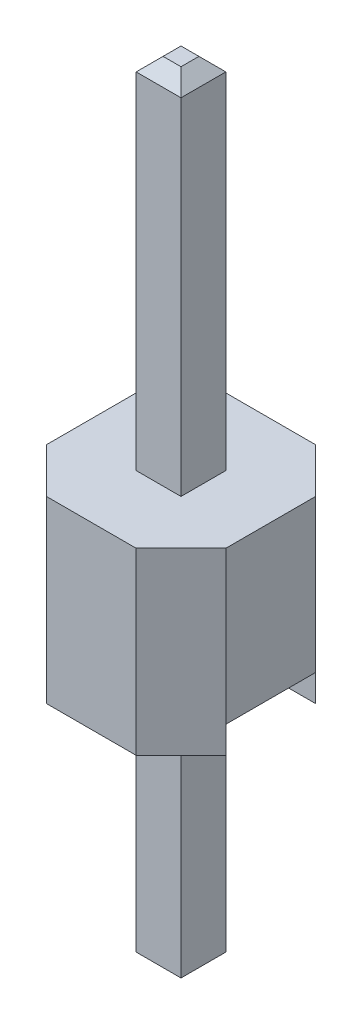
ISO-10303-21;
HEADER;
FILE_DESCRIPTION(('STEP AP214'),'2;1');
FILE_NAME('part.step','',(''),(''),'','','');
FILE_SCHEMA(('AUTOMOTIVE_DESIGN { 1 0 10303 214 1 1 1 1 }'));
ENDSEC;
DATA;
#1=APPLICATION_CONTEXT('core data for automotive mechanical design processes');
#2=APPLICATION_PROTOCOL_DEFINITION('international standard','automotive_design',2000,#1);
#3=PRODUCT_CONTEXT('',#1,'mechanical');
#4=PRODUCT('Part','Part','',(#3));
#5=PRODUCT_RELATED_PRODUCT_CATEGORY('part','',(#4));
#6=PRODUCT_DEFINITION_FORMATION('','',#4);
#7=PRODUCT_DEFINITION_CONTEXT('part definition',#1,'design');
#8=PRODUCT_DEFINITION('design','',#6,#7);
#9=PRODUCT_DEFINITION_SHAPE('','',#8);
#10=(LENGTH_UNIT() NAMED_UNIT(*) SI_UNIT(.MILLI.,.METRE.));
#11=(NAMED_UNIT(*) PLANE_ANGLE_UNIT() SI_UNIT($,.RADIAN.));
#12=(NAMED_UNIT(*) SI_UNIT($,.STERADIAN.) SOLID_ANGLE_UNIT());
#13=UNCERTAINTY_MEASURE_WITH_UNIT(LENGTH_MEASURE(1.E-05),#10,'distance_accuracy_value','');
#14=(GEOMETRIC_REPRESENTATION_CONTEXT(3) GLOBAL_UNCERTAINTY_ASSIGNED_CONTEXT((#13)) GLOBAL_UNIT_ASSIGNED_CONTEXT((#10,
#11,#12)) REPRESENTATION_CONTEXT('',''));
#15=CARTESIAN_POINT('',(0.,0.,0.));
#16=DIRECTION('',(0.,0.,1.));
#17=DIRECTION('',(1.,0.,0.));
#18=AXIS2_PLACEMENT_3D('',#15,#16,#17);
#19=CARTESIAN_POINT('',(-0.127000000000002,-3.556,0.));
#20=DIRECTION('',(0.707106781186548,0.707106781186548,0.));
#21=DIRECTION('',(0.,0.,-1.));
#22=AXIS2_PLACEMENT_3D('',#19,#20,#21);
#23=PLANE('',#22);
#24=DIRECTION('',(-0.577350269189626,0.577350269189626,0.577350269189626));
#25=VECTOR('',#24,1.);
#26=CARTESIAN_POINT('',(-0.084666666666668,-3.59833333333333,0.0846666666666681));
#27=LINE('',#26,#25);
#28=CARTESIAN_POINT('',(-0.127000000000002,-3.556,0.127000000000002));
#29=VERTEX_POINT('',#28);
#30=CARTESIAN_POINT('',(-0.3175,-3.3655,0.3175));
#31=VERTEX_POINT('',#30);
#32=EDGE_CURVE('E29',#29,#31,#27,.T.);
#33=ORIENTED_EDGE('',*,*,#32,.T.);
#34=DIRECTION('',(0.,0.,1.));
#35=VECTOR('',#34,1.);
#36=CARTESIAN_POINT('',(-0.3175,-3.3655,-0.3175));
#37=LINE('',#36,#35);
#38=CARTESIAN_POINT('',(-0.3175,-3.3655,-0.3175));
#39=VERTEX_POINT('',#38);
#40=EDGE_CURVE('E273',#39,#31,#37,.T.);
#41=ORIENTED_EDGE('',*,*,#40,.F.);
#42=DIRECTION('',(0.577350269189626,-0.577350269189626,0.577350269189626));
#43=VECTOR('',#42,1.);
#44=CARTESIAN_POINT('',(-0.084666666666668,-3.59833333333333,-0.084666666666668));
#45=LINE('',#44,#43);
#46=CARTESIAN_POINT('',(-0.127000000000002,-3.556,-0.127000000000002));
#47=VERTEX_POINT('',#46);
#48=EDGE_CURVE('E11',#39,#47,#45,.T.);
#49=ORIENTED_EDGE('',*,*,#48,.T.);
#50=DIRECTION('',(0.,0.,-1.));
#51=VECTOR('',#50,1.);
#52=CARTESIAN_POINT('',(-0.127000000000002,-3.556,0.));
#53=LINE('',#52,#51);
#54=EDGE_CURVE('E256',#29,#47,#53,.T.);
#55=ORIENTED_EDGE('',*,*,#54,.F.);
#56=EDGE_LOOP('',(#33,#41,#49,#55));
#57=FACE_BOUND('',#56,.T.);
#58=ADVANCED_FACE('F18',(#57),#23,.F.);
#59=CARTESIAN_POINT('',(0.,-3.556,-0.127000000000002));
#60=DIRECTION('',(0.,0.707106781186548,0.707106781186548));
#61=DIRECTION('',(1.,0.,0.));
#62=AXIS2_PLACEMENT_3D('',#59,#60,#61);
#63=PLANE('',#62);
#64=DIRECTION('',(-0.577350269189626,-0.577350269189626,0.577350269189626));
#65=VECTOR('',#64,1.);
#66=CARTESIAN_POINT('',(0.084666666666668,-3.59833333333333,-0.084666666666668));
#67=LINE('',#66,#65);
#68=CARTESIAN_POINT('',(0.3175,-3.3655,-0.3175));
#69=VERTEX_POINT('',#68);
#70=CARTESIAN_POINT('',(0.127000000000002,-3.556,-0.127000000000002));
#71=VERTEX_POINT('',#70);
#72=EDGE_CURVE('E44',#69,#71,#67,.T.);
#73=ORIENTED_EDGE('',*,*,#72,.T.);
#74=DIRECTION('',(1.,0.,0.));
#75=VECTOR('',#74,1.);
#76=CARTESIAN_POINT('',(0.,-3.556,-0.127000000000002));
#77=LINE('',#76,#75);
#78=EDGE_CURVE('E260',#47,#71,#77,.T.);
#79=ORIENTED_EDGE('',*,*,#78,.F.);
#80=ORIENTED_EDGE('',*,*,#48,.F.);
#81=DIRECTION('',(-1.,0.,0.));
#82=VECTOR('',#81,1.);
#83=CARTESIAN_POINT('',(-0.3175,-3.3655,-0.3175));
#84=LINE('',#83,#82);
#85=EDGE_CURVE('E266',#69,#39,#84,.T.);
#86=ORIENTED_EDGE('',*,*,#85,.F.);
#87=EDGE_LOOP('',(#73,#79,#80,#86));
#88=FACE_BOUND('',#87,.T.);
#89=ADVANCED_FACE('F431',(#88),#63,.F.);
#90=CARTESIAN_POINT('',(0.,-3.556,0.127000000000002));
#91=DIRECTION('',(0.,0.707106781186548,-0.707106781186548));
#92=DIRECTION('',(-1.,0.,0.));
#93=AXIS2_PLACEMENT_3D('',#90,#91,#92);
#94=PLANE('',#93);
#95=DIRECTION('',(0.577350269189626,0.577350269189626,0.577350269189626));
#96=VECTOR('',#95,1.);
#97=CARTESIAN_POINT('',(0.084666666666668,-3.59833333333333,0.0846666666666681));
#98=LINE('',#97,#96);
#99=CARTESIAN_POINT('',(0.127000000000002,-3.556,0.127000000000002));
#100=VERTEX_POINT('',#99);
#101=CARTESIAN_POINT('',(0.3175,-3.3655,0.3175));
#102=VERTEX_POINT('',#101);
#103=EDGE_CURVE('E254',#100,#102,#98,.T.);
#104=ORIENTED_EDGE('',*,*,#103,.T.);
#105=DIRECTION('',(1.,0.,0.));
#106=VECTOR('',#105,1.);
#107=CARTESIAN_POINT('',(-0.3175,-3.3655,0.3175));
#108=LINE('',#107,#106);
#109=EDGE_CURVE('E248',#31,#102,#108,.T.);
#110=ORIENTED_EDGE('',*,*,#109,.F.);
#111=ORIENTED_EDGE('',*,*,#32,.F.);
#112=DIRECTION('',(-1.,0.,0.));
#113=VECTOR('',#112,1.);
#114=CARTESIAN_POINT('',(0.,-3.556,0.127000000000002));
#115=LINE('',#114,#113);
#116=EDGE_CURVE('E247',#100,#29,#115,.T.);
#117=ORIENTED_EDGE('',*,*,#116,.F.);
#118=EDGE_LOOP('',(#104,#110,#111,#117));
#119=FACE_BOUND('',#118,.T.);
#120=ADVANCED_FACE('F245',(#119),#94,.F.);
#121=CARTESIAN_POINT('',(0.127000000000002,-3.556,0.));
#122=DIRECTION('',(-0.707106781186548,0.707106781186548,0.));
#123=DIRECTION('',(0.,0.,1.));
#124=AXIS2_PLACEMENT_3D('',#121,#122,#123);
#125=PLANE('',#124);
#126=ORIENTED_EDGE('',*,*,#72,.F.);
#127=DIRECTION('',(0.,0.,-1.));
#128=VECTOR('',#127,1.);
#129=CARTESIAN_POINT('',(0.3175,-3.3655,-0.3175));
#130=LINE('',#129,#128);
#131=EDGE_CURVE('E332',#102,#69,#130,.T.);
#132=ORIENTED_EDGE('',*,*,#131,.F.);
#133=ORIENTED_EDGE('',*,*,#103,.F.);
#134=DIRECTION('',(0.,0.,1.));
#135=VECTOR('',#134,1.);
#136=CARTESIAN_POINT('',(0.127000000000002,-3.556,0.));
#137=LINE('',#136,#135);
#138=EDGE_CURVE('E264',#71,#100,#137,.T.);
#139=ORIENTED_EDGE('',*,*,#138,.F.);
#140=EDGE_LOOP('',(#126,#132,#133,#139));
#141=FACE_BOUND('',#140,.T.);
#142=ADVANCED_FACE('F439',(#141),#125,.F.);
#143=CARTESIAN_POINT('',(0.,-3.556,0.));
#144=DIRECTION('',(0.,1.,0.));
#145=DIRECTION('',(1.,0.,0.));
#146=AXIS2_PLACEMENT_3D('',#143,#144,#145);
#147=PLANE('',#146);
#148=ORIENTED_EDGE('',*,*,#116,.T.);
#149=ORIENTED_EDGE('',*,*,#54,.T.);
#150=ORIENTED_EDGE('',*,*,#78,.T.);
#151=ORIENTED_EDGE('',*,*,#138,.T.);
#152=EDGE_LOOP('',(#148,#149,#150,#151));
#153=FACE_BOUND('',#152,.T.);
#154=ADVANCED_FACE('F263',(#153),#147,.F.);
#155=CARTESIAN_POINT('',(-0.3175,-3.556,-0.3175));
#156=DIRECTION('',(0.,0.,1.));
#157=DIRECTION('',(1.,0.,0.));
#158=AXIS2_PLACEMENT_3D('',#155,#156,#157);
#159=PLANE('',#158);
#160=DIRECTION('',(0.,1.,0.));
#161=VECTOR('',#160,1.);
#162=CARTESIAN_POINT('',(0.3175,-3.556,-0.3175));
#163=LINE('',#162,#161);
#164=CARTESIAN_POINT('',(0.3175,0.381,-0.3175));
#165=VERTEX_POINT('',#164);
#166=EDGE_CURVE('E99',#69,#165,#163,.T.);
#167=ORIENTED_EDGE('',*,*,#166,.F.);
#168=ORIENTED_EDGE('',*,*,#85,.T.);
#169=DIRECTION('',(0.,1.,0.));
#170=VECTOR('',#169,1.);
#171=CARTESIAN_POINT('',(-0.3175,-3.556,-0.3175));
#172=LINE('',#171,#170);
#173=CARTESIAN_POINT('',(-0.3175,0.381,-0.3175));
#174=VERTEX_POINT('',#173);
#175=EDGE_CURVE('E300',#39,#174,#172,.T.);
#176=ORIENTED_EDGE('',*,*,#175,.T.);
#177=DIRECTION('',(1.,0.,0.));
#178=VECTOR('',#177,1.);
#179=CARTESIAN_POINT('',(-0.3175,0.381,-0.3175));
#180=LINE('',#179,#178);
#181=EDGE_CURVE('E429',#174,#165,#180,.T.);
#182=ORIENTED_EDGE('',*,*,#181,.T.);
#183=EDGE_LOOP('',(#167,#168,#176,#182));
#184=FACE_BOUND('',#183,.T.);
#185=ADVANCED_FACE('F428',(#184),#159,.F.);
#186=CARTESIAN_POINT('',(-0.3175,-3.556,-0.3175));
#187=DIRECTION('',(1.,0.,0.));
#188=DIRECTION('',(0.,1.,0.));
#189=AXIS2_PLACEMENT_3D('',#186,#187,#188);
#190=PLANE('',#189);
#191=ORIENTED_EDGE('',*,*,#175,.F.);
#192=ORIENTED_EDGE('',*,*,#40,.T.);
#193=DIRECTION('',(0.,1.,0.));
#194=VECTOR('',#193,1.);
#195=CARTESIAN_POINT('',(-0.3175,-3.556,0.3175));
#196=LINE('',#195,#194);
#197=CARTESIAN_POINT('',(-0.3175,0.381,0.3175));
#198=VERTEX_POINT('',#197);
#199=EDGE_CURVE('E336',#31,#198,#196,.T.);
#200=ORIENTED_EDGE('',*,*,#199,.T.);
#201=DIRECTION('',(0.,0.,-1.));
#202=VECTOR('',#201,1.);
#203=CARTESIAN_POINT('',(-0.3175,0.381,-0.3175));
#204=LINE('',#203,#202);
#205=EDGE_CURVE('E425',#198,#174,#204,.T.);
#206=ORIENTED_EDGE('',*,*,#205,.T.);
#207=EDGE_LOOP('',(#191,#192,#200,#206));
#208=FACE_BOUND('',#207,.T.);
#209=ADVANCED_FACE('F422',(#208),#190,.F.);
#210=CARTESIAN_POINT('',(-0.3175,-3.556,0.3175));
#211=DIRECTION('',(0.,0.,-1.));
#212=DIRECTION('',(0.,-1.,0.));
#213=AXIS2_PLACEMENT_3D('',#210,#211,#212);
#214=PLANE('',#213);
#215=ORIENTED_EDGE('',*,*,#199,.F.);
#216=ORIENTED_EDGE('',*,*,#109,.T.);
#217=DIRECTION('',(0.,1.,0.));
#218=VECTOR('',#217,1.);
#219=CARTESIAN_POINT('',(0.3175,-3.556,0.3175));
#220=LINE('',#219,#218);
#221=CARTESIAN_POINT('',(0.3175,0.381,0.3175));
#222=VERTEX_POINT('',#221);
#223=EDGE_CURVE('E81',#102,#222,#220,.T.);
#224=ORIENTED_EDGE('',*,*,#223,.T.);
#225=DIRECTION('',(-1.,0.,0.));
#226=VECTOR('',#225,1.);
#227=CARTESIAN_POINT('',(-0.3175,0.381,0.3175));
#228=LINE('',#227,#226);
#229=EDGE_CURVE('E574',#222,#198,#228,.T.);
#230=ORIENTED_EDGE('',*,*,#229,.T.);
#231=EDGE_LOOP('',(#215,#216,#224,#230));
#232=FACE_BOUND('',#231,.T.);
#233=ADVANCED_FACE('F485',(#232),#214,.F.);
#234=CARTESIAN_POINT('',(0.3175,-3.556,-0.3175));
#235=DIRECTION('',(-1.,0.,0.));
#236=DIRECTION('',(0.,0.,1.));
#237=AXIS2_PLACEMENT_3D('',#234,#235,#236);
#238=PLANE('',#237);
#239=ORIENTED_EDGE('',*,*,#223,.F.);
#240=ORIENTED_EDGE('',*,*,#131,.T.);
#241=ORIENTED_EDGE('',*,*,#166,.T.);
#242=DIRECTION('',(0.,0.,1.));
#243=VECTOR('',#242,1.);
#244=CARTESIAN_POINT('',(0.3175,0.381,-0.3175));
#245=LINE('',#244,#243);
#246=EDGE_CURVE('E547',#165,#222,#245,.T.);
#247=ORIENTED_EDGE('',*,*,#246,.T.);
#248=EDGE_LOOP('',(#239,#240,#241,#247));
#249=FACE_BOUND('',#248,.T.);
#250=ADVANCED_FACE('F486',(#249),#238,.F.);
#251=CARTESIAN_POINT('',(0.,7.62,-0.127));
#252=DIRECTION('',(0.,-0.707106781186546,0.707106781186549));
#253=DIRECTION('',(-1.,0.,0.));
#254=AXIS2_PLACEMENT_3D('',#251,#252,#253);
#255=PLANE('',#254);
#256=DIRECTION('',(0.577350269189625,-0.577350269189628,-0.577350269189625));
#257=VECTOR('',#256,1.);
#258=CARTESIAN_POINT('',(0.0846666666666676,7.66233333333333,-0.0846666666666676));
#259=LINE('',#258,#257);
#260=CARTESIAN_POINT('',(0.127000000000001,7.62,-0.127));
#261=VERTEX_POINT('',#260);
#262=CARTESIAN_POINT('',(0.3175,7.4295,-0.3175));
#263=VERTEX_POINT('',#262);
#264=EDGE_CURVE('E298',#261,#263,#259,.T.);
#265=ORIENTED_EDGE('',*,*,#264,.T.);
#266=DIRECTION('',(1.,0.,0.));
#267=VECTOR('',#266,1.);
#268=CARTESIAN_POINT('',(-0.3175,7.4295,-0.3175));
#269=LINE('',#268,#267);
#270=CARTESIAN_POINT('',(-0.3175,7.4295,-0.3175));
#271=VERTEX_POINT('',#270);
#272=EDGE_CURVE('E344',#271,#263,#269,.T.);
#273=ORIENTED_EDGE('',*,*,#272,.F.);
#274=DIRECTION('',(0.577350269189625,0.577350269189628,0.577350269189625));
#275=VECTOR('',#274,1.);
#276=CARTESIAN_POINT('',(-0.0846666666666676,7.66233333333333,-0.0846666666666676));
#277=LINE('',#276,#275);
#278=CARTESIAN_POINT('',(-0.127000000000001,7.62,-0.127));
#279=VERTEX_POINT('',#278);
#280=EDGE_CURVE('E333',#271,#279,#277,.T.);
#281=ORIENTED_EDGE('',*,*,#280,.T.);
#282=DIRECTION('',(-1.,0.,0.));
#283=VECTOR('',#282,1.);
#284=CARTESIAN_POINT('',(0.,7.62,-0.127));
#285=LINE('',#284,#283);
#286=EDGE_CURVE('E350',#261,#279,#285,.T.);
#287=ORIENTED_EDGE('',*,*,#286,.F.);
#288=EDGE_LOOP('',(#265,#273,#281,#287));
#289=FACE_BOUND('',#288,.T.);
#290=ADVANCED_FACE('F489',(#289),#255,.F.);
#291=CARTESIAN_POINT('',(-0.127000000000001,7.62,0.));
#292=DIRECTION('',(0.707106781186549,-0.707106781186546,0.));
#293=DIRECTION('',(0.,0.,-1.));
#294=AXIS2_PLACEMENT_3D('',#291,#292,#293);
#295=PLANE('',#294);
#296=DIRECTION('',(0.577350269189625,0.577350269189628,-0.577350269189625));
#297=VECTOR('',#296,1.);
#298=CARTESIAN_POINT('',(-0.0846666666666676,7.66233333333333,0.0846666666666676));
#299=LINE('',#298,#297);
#300=CARTESIAN_POINT('',(-0.3175,7.4295,0.3175));
#301=VERTEX_POINT('',#300);
#302=CARTESIAN_POINT('',(-0.127000000000001,7.62,0.127000000000001));
#303=VERTEX_POINT('',#302);
#304=EDGE_CURVE('E299',#301,#303,#299,.T.);
#305=ORIENTED_EDGE('',*,*,#304,.T.);
#306=DIRECTION('',(0.,0.,1.));
#307=VECTOR('',#306,1.);
#308=CARTESIAN_POINT('',(-0.127000000000001,7.62,0.));
#309=LINE('',#308,#307);
#310=EDGE_CURVE('E354',#279,#303,#309,.T.);
#311=ORIENTED_EDGE('',*,*,#310,.F.);
#312=ORIENTED_EDGE('',*,*,#280,.F.);
#313=DIRECTION('',(0.,0.,-1.));
#314=VECTOR('',#313,1.);
#315=CARTESIAN_POINT('',(-0.3175,7.4295,0.3175));
#316=LINE('',#315,#314);
#317=EDGE_CURVE('E363',#301,#271,#316,.T.);
#318=ORIENTED_EDGE('',*,*,#317,.F.);
#319=EDGE_LOOP('',(#305,#311,#312,#318));
#320=FACE_BOUND('',#319,.T.);
#321=ADVANCED_FACE('F466',(#320),#295,.F.);
#322=CARTESIAN_POINT('',(0.127000000000001,7.62,0.));
#323=DIRECTION('',(-0.707106781186549,-0.707106781186546,0.));
#324=DIRECTION('',(-0.707106781186546,0.707106781186549,0.));
#325=AXIS2_PLACEMENT_3D('',#322,#323,#324);
#326=PLANE('',#325);
#327=DIRECTION('',(0.577350269189625,-0.577350269189628,0.577350269189625));
#328=VECTOR('',#327,1.);
#329=CARTESIAN_POINT('',(0.0846666666666676,7.66233333333333,0.0846666666666676));
#330=LINE('',#329,#328);
#331=CARTESIAN_POINT('',(0.127000000000001,7.62,0.127000000000001));
#332=VERTEX_POINT('',#331);
#333=CARTESIAN_POINT('',(0.3175,7.4295,0.3175));
#334=VERTEX_POINT('',#333);
#335=EDGE_CURVE('E295',#332,#334,#330,.T.);
#336=ORIENTED_EDGE('',*,*,#335,.T.);
#337=DIRECTION('',(0.,0.,1.));
#338=VECTOR('',#337,1.);
#339=CARTESIAN_POINT('',(0.3175,7.4295,0.3175));
#340=LINE('',#339,#338);
#341=EDGE_CURVE('E294',#263,#334,#340,.T.);
#342=ORIENTED_EDGE('',*,*,#341,.F.);
#343=ORIENTED_EDGE('',*,*,#264,.F.);
#344=DIRECTION('',(0.,0.,-1.));
#345=VECTOR('',#344,1.);
#346=CARTESIAN_POINT('',(0.127000000000001,7.62,0.));
#347=LINE('',#346,#345);
#348=EDGE_CURVE('E355',#332,#261,#347,.T.);
#349=ORIENTED_EDGE('',*,*,#348,.F.);
#350=EDGE_LOOP('',(#336,#342,#343,#349));
#351=FACE_BOUND('',#350,.T.);
#352=ADVANCED_FACE('F462',(#351),#326,.F.);
#353=CARTESIAN_POINT('',(0.,7.62,0.127000000000001));
#354=DIRECTION('',(0.,-0.707106781186546,-0.707106781186549));
#355=DIRECTION('',(0.,-0.707106781186549,0.707106781186546));
#356=AXIS2_PLACEMENT_3D('',#353,#354,#355);
#357=PLANE('',#356);
#358=ORIENTED_EDGE('',*,*,#304,.F.);
#359=DIRECTION('',(-1.,0.,0.));
#360=VECTOR('',#359,1.);
#361=CARTESIAN_POINT('',(-0.3175,7.4295,0.3175));
#362=LINE('',#361,#360);
#363=EDGE_CURVE('E367',#334,#301,#362,.T.);
#364=ORIENTED_EDGE('',*,*,#363,.F.);
#365=ORIENTED_EDGE('',*,*,#335,.F.);
#366=DIRECTION('',(1.,0.,0.));
#367=VECTOR('',#366,1.);
#368=CARTESIAN_POINT('',(0.,7.62,0.127000000000001));
#369=LINE('',#368,#367);
#370=EDGE_CURVE('E347',#303,#332,#369,.T.);
#371=ORIENTED_EDGE('',*,*,#370,.F.);
#372=EDGE_LOOP('',(#358,#364,#365,#371));
#373=FACE_BOUND('',#372,.T.);
#374=ADVANCED_FACE('F465',(#373),#357,.F.);
#375=CARTESIAN_POINT('',(0.,7.62,0.));
#376=DIRECTION('',(0.,-1.,0.));
#377=DIRECTION('',(0.,0.,-1.));
#378=AXIS2_PLACEMENT_3D('',#375,#376,#377);
#379=PLANE('',#378);
#380=ORIENTED_EDGE('',*,*,#348,.T.);
#381=ORIENTED_EDGE('',*,*,#286,.T.);
#382=ORIENTED_EDGE('',*,*,#310,.T.);
#383=ORIENTED_EDGE('',*,*,#370,.T.);
#384=EDGE_LOOP('',(#380,#381,#382,#383));
#385=FACE_BOUND('',#384,.T.);
#386=ADVANCED_FACE('F476',(#385),#379,.F.);
#387=CARTESIAN_POINT('',(-0.3175,7.62,0.3175));
#388=DIRECTION('',(0.,0.,-1.));
#389=DIRECTION('',(0.,-1.,0.));
#390=AXIS2_PLACEMENT_3D('',#387,#388,#389);
#391=PLANE('',#390);
#392=DIRECTION('',(0.,-1.,0.));
#393=VECTOR('',#392,1.);
#394=CARTESIAN_POINT('',(0.3175,7.62,0.3175));
#395=LINE('',#394,#393);
#396=CARTESIAN_POINT('',(0.3175,2.54,0.3175));
#397=VERTEX_POINT('',#396);
#398=EDGE_CURVE('E290',#334,#397,#395,.T.);
#399=ORIENTED_EDGE('',*,*,#398,.F.);
#400=ORIENTED_EDGE('',*,*,#363,.T.);
#401=DIRECTION('',(0.,-1.,0.));
#402=VECTOR('',#401,1.);
#403=CARTESIAN_POINT('',(-0.3175,7.62,0.3175));
#404=LINE('',#403,#402);
#405=CARTESIAN_POINT('',(-0.3175,2.54,0.3175));
#406=VERTEX_POINT('',#405);
#407=EDGE_CURVE('E368',#301,#406,#404,.T.);
#408=ORIENTED_EDGE('',*,*,#407,.T.);
#409=DIRECTION('',(1.,0.,0.));
#410=VECTOR('',#409,1.);
#411=CARTESIAN_POINT('',(-0.3175,2.54,0.3175));
#412=LINE('',#411,#410);
#413=EDGE_CURVE('E410',#406,#397,#412,.T.);
#414=ORIENTED_EDGE('',*,*,#413,.T.);
#415=EDGE_LOOP('',(#399,#400,#408,#414));
#416=FACE_BOUND('',#415,.T.);
#417=ADVANCED_FACE('F472',(#416),#391,.F.);
#418=CARTESIAN_POINT('',(-0.3175,7.62,0.3175));
#419=DIRECTION('',(1.,0.,0.));
#420=DIRECTION('',(0.,1.,0.));
#421=AXIS2_PLACEMENT_3D('',#418,#419,#420);
#422=PLANE('',#421);
#423=ORIENTED_EDGE('',*,*,#407,.F.);
#424=ORIENTED_EDGE('',*,*,#317,.T.);
#425=DIRECTION('',(0.,-1.,0.));
#426=VECTOR('',#425,1.);
#427=CARTESIAN_POINT('',(-0.3175,7.62,-0.3175));
#428=LINE('',#427,#426);
#429=CARTESIAN_POINT('',(-0.3175,2.54,-0.3175));
#430=VERTEX_POINT('',#429);
#431=EDGE_CURVE('E293',#271,#430,#428,.T.);
#432=ORIENTED_EDGE('',*,*,#431,.T.);
#433=DIRECTION('',(0.,0.,1.));
#434=VECTOR('',#433,1.);
#435=CARTESIAN_POINT('',(-0.3175,2.54,0.3175));
#436=LINE('',#435,#434);
#437=EDGE_CURVE('E398',#430,#406,#436,.T.);
#438=ORIENTED_EDGE('',*,*,#437,.T.);
#439=EDGE_LOOP('',(#423,#424,#432,#438));
#440=FACE_BOUND('',#439,.T.);
#441=ADVANCED_FACE('F468',(#440),#422,.F.);
#442=CARTESIAN_POINT('',(-0.3175,7.62,-0.3175));
#443=DIRECTION('',(0.,0.,1.));
#444=DIRECTION('',(1.,0.,0.));
#445=AXIS2_PLACEMENT_3D('',#442,#443,#444);
#446=PLANE('',#445);
#447=ORIENTED_EDGE('',*,*,#431,.F.);
#448=ORIENTED_EDGE('',*,*,#272,.T.);
#449=DIRECTION('',(0.,-1.,0.));
#450=VECTOR('',#449,1.);
#451=CARTESIAN_POINT('',(0.3175,7.62,-0.3175));
#452=LINE('',#451,#450);
#453=CARTESIAN_POINT('',(0.3175,2.54,-0.3175));
#454=VERTEX_POINT('',#453);
#455=EDGE_CURVE('E388',#263,#454,#452,.T.);
#456=ORIENTED_EDGE('',*,*,#455,.T.);
#457=DIRECTION('',(-1.,0.,0.));
#458=VECTOR('',#457,1.);
#459=CARTESIAN_POINT('',(-0.3175,2.54,-0.3175));
#460=LINE('',#459,#458);
#461=EDGE_CURVE('E375',#454,#430,#460,.T.);
#462=ORIENTED_EDGE('',*,*,#461,.T.);
#463=EDGE_LOOP('',(#447,#448,#456,#462));
#464=FACE_BOUND('',#463,.T.);
#465=ADVANCED_FACE('F471',(#464),#446,.F.);
#466=CARTESIAN_POINT('',(0.3175,7.62,0.3175));
#467=DIRECTION('',(-1.,0.,0.));
#468=DIRECTION('',(0.,0.,1.));
#469=AXIS2_PLACEMENT_3D('',#466,#467,#468);
#470=PLANE('',#469);
#471=ORIENTED_EDGE('',*,*,#455,.F.);
#472=ORIENTED_EDGE('',*,*,#341,.T.);
#473=ORIENTED_EDGE('',*,*,#398,.T.);
#474=DIRECTION('',(0.,0.,-1.));
#475=VECTOR('',#474,1.);
#476=CARTESIAN_POINT('',(0.3175,2.54,0.3175));
#477=LINE('',#476,#475);
#478=EDGE_CURVE('E379',#397,#454,#477,.T.);
#479=ORIENTED_EDGE('',*,*,#478,.T.);
#480=EDGE_LOOP('',(#471,#472,#473,#479));
#481=FACE_BOUND('',#480,.T.);
#482=ADVANCED_FACE('F495',(#481),#470,.F.);
#483=CARTESIAN_POINT('',(-2.59591892663164,0.,0.635));
#484=DIRECTION('',(0.,0.,1.));
#485=DIRECTION('',(0.,-1.,0.));
#486=AXIS2_PLACEMENT_3D('',#483,#484,#485);
#487=PLANE('',#486);
#488=DIRECTION('',(0.,1.,0.));
#489=VECTOR('',#488,1.);
#490=CARTESIAN_POINT('',(-1.27,0.,0.635));
#491=LINE('',#490,#489);
#492=CARTESIAN_POINT('',(-1.27,0.,0.635));
#493=VERTEX_POINT('',#492);
#494=CARTESIAN_POINT('',(-1.27,0.381,0.635));
#495=VERTEX_POINT('',#494);
#496=EDGE_CURVE('E289',#493,#495,#491,.T.);
#497=ORIENTED_EDGE('',*,*,#496,.T.);
#498=DIRECTION('',(1.,0.,0.));
#499=VECTOR('',#498,1.);
#500=CARTESIAN_POINT('',(-2.59591892663164,0.381,0.635));
#501=LINE('',#500,#499);
#502=CARTESIAN_POINT('',(1.27,0.381,0.635));
#503=VERTEX_POINT('',#502);
#504=EDGE_CURVE('E22',#495,#503,#501,.T.);
#505=ORIENTED_EDGE('',*,*,#504,.T.);
#506=DIRECTION('',(0.,-1.,0.));
#507=VECTOR('',#506,1.);
#508=CARTESIAN_POINT('',(1.27,0.,0.635));
#509=LINE('',#508,#507);
#510=CARTESIAN_POINT('',(1.27,0.,0.635));
#511=VERTEX_POINT('',#510);
#512=EDGE_CURVE('E277',#503,#511,#509,.T.);
#513=ORIENTED_EDGE('',*,*,#512,.T.);
#514=DIRECTION('',(1.,0.,0.));
#515=VECTOR('',#514,1.);
#516=CARTESIAN_POINT('',(-2.59591892663164,0.,0.635));
#517=LINE('',#516,#515);
#518=EDGE_CURVE('E322',#493,#511,#517,.T.);
#519=ORIENTED_EDGE('',*,*,#518,.F.);
#520=EDGE_LOOP('',(#497,#505,#513,#519));
#521=FACE_BOUND('',#520,.T.);
#522=ADVANCED_FACE('F460',(#521),#487,.F.);
#523=CARTESIAN_POINT('',(-2.59591892663164,0.,-0.635));
#524=DIRECTION('',(0.,0.,-1.));
#525=DIRECTION('',(-1.,0.,0.));
#526=AXIS2_PLACEMENT_3D('',#523,#524,#525);
#527=PLANE('',#526);
#528=DIRECTION('',(0.,-1.,0.));
#529=VECTOR('',#528,1.);
#530=CARTESIAN_POINT('',(-1.27,0.,-0.635));
#531=LINE('',#530,#529);
#532=CARTESIAN_POINT('',(-1.27,0.381,-0.635));
#533=VERTEX_POINT('',#532);
#534=CARTESIAN_POINT('',(-1.27,0.,-0.635));
#535=VERTEX_POINT('',#534);
#536=EDGE_CURVE('E215',#533,#535,#531,.T.);
#537=ORIENTED_EDGE('',*,*,#536,.T.);
#538=DIRECTION('',(1.,0.,0.));
#539=VECTOR('',#538,1.);
#540=CARTESIAN_POINT('',(-2.59591892663164,0.,-0.635));
#541=LINE('',#540,#539);
#542=CARTESIAN_POINT('',(1.27,0.,-0.635));
#543=VERTEX_POINT('',#542);
#544=EDGE_CURVE('E397',#535,#543,#541,.T.);
#545=ORIENTED_EDGE('',*,*,#544,.T.);
#546=DIRECTION('',(0.,1.,0.));
#547=VECTOR('',#546,1.);
#548=CARTESIAN_POINT('',(1.27,0.,-0.635));
#549=LINE('',#548,#547);
#550=CARTESIAN_POINT('',(1.27,0.381,-0.635));
#551=VERTEX_POINT('',#550);
#552=EDGE_CURVE('E319',#543,#551,#549,.T.);
#553=ORIENTED_EDGE('',*,*,#552,.T.);
#554=DIRECTION('',(1.,0.,0.));
#555=VECTOR('',#554,1.);
#556=CARTESIAN_POINT('',(-2.59591892663164,0.381,-0.635));
#557=LINE('',#556,#555);
#558=EDGE_CURVE('E283',#533,#551,#557,.T.);
#559=ORIENTED_EDGE('',*,*,#558,.F.);
#560=EDGE_LOOP('',(#537,#545,#553,#559));
#561=FACE_BOUND('',#560,.T.);
#562=ADVANCED_FACE('F457',(#561),#527,.F.);
#563=CARTESIAN_POINT('',(0.,0.,0.));
#564=DIRECTION('',(0.,1.,0.));
#565=DIRECTION('',(1.,0.,0.));
#566=AXIS2_PLACEMENT_3D('',#563,#564,#565);
#567=PLANE('',#566);
#568=DIRECTION('',(0.707106781186543,0.,0.707106781186553));
#569=VECTOR('',#568,1.);
#570=CARTESIAN_POINT('',(-0.635000000000008,0.,1.27));
#571=LINE('',#570,#569);
#572=CARTESIAN_POINT('',(-0.635000000000008,0.,1.27));
#573=VERTEX_POINT('',#572);
#574=EDGE_CURVE('E386',#493,#573,#571,.T.);
#575=ORIENTED_EDGE('',*,*,#574,.F.);
#576=ORIENTED_EDGE('',*,*,#518,.T.);
#577=DIRECTION('',(0.70710678118655,0.,-0.707106781186545));
#578=VECTOR('',#577,1.);
#579=CARTESIAN_POINT('',(1.27,0.,0.635));
#580=LINE('',#579,#578);
#581=CARTESIAN_POINT('',(0.635,0.,1.27));
#582=VERTEX_POINT('',#581);
#583=EDGE_CURVE('E318',#582,#511,#580,.T.);
#584=ORIENTED_EDGE('',*,*,#583,.F.);
#585=DIRECTION('',(1.,0.,0.));
#586=VECTOR('',#585,1.);
#587=CARTESIAN_POINT('',(-0.635000000000008,0.,1.27));
#588=LINE('',#587,#586);
#589=EDGE_CURVE('E284',#573,#582,#588,.T.);
#590=ORIENTED_EDGE('',*,*,#589,.F.);
#591=EDGE_LOOP('',(#575,#576,#584,#590));
#592=FACE_BOUND('',#591,.T.);
#593=ADVANCED_FACE('F459',(#592),#567,.F.);
#594=CARTESIAN_POINT('',(0.635,2.54,-1.27));
#595=DIRECTION('',(-0.707106781186548,0.,0.707106781186548));
#596=DIRECTION('',(0.,1.,0.));
#597=AXIS2_PLACEMENT_3D('',#594,#595,#596);
#598=PLANE('',#597);
#599=DIRECTION('',(-0.707106781186548,0.,-0.707106781186548));
#600=VECTOR('',#599,1.);
#601=CARTESIAN_POINT('',(0.635,0.,-1.27));
#602=LINE('',#601,#600);
#603=CARTESIAN_POINT('',(0.635,0.,-1.27));
#604=VERTEX_POINT('',#603);
#605=EDGE_CURVE('E393',#543,#604,#602,.T.);
#606=ORIENTED_EDGE('',*,*,#605,.T.);
#607=DIRECTION('',(0.,-1.,0.));
#608=VECTOR('',#607,1.);
#609=CARTESIAN_POINT('',(0.635,2.54,-1.27));
#610=LINE('',#609,#608);
#611=CARTESIAN_POINT('',(0.635,2.54,-1.27));
#612=VERTEX_POINT('',#611);
#613=EDGE_CURVE('E358',#612,#604,#610,.T.);
#614=ORIENTED_EDGE('',*,*,#613,.F.);
#615=DIRECTION('',(-0.707106781186548,0.,-0.707106781186548));
#616=VECTOR('',#615,1.);
#617=CARTESIAN_POINT('',(0.635,2.54,-1.27));
#618=LINE('',#617,#616);
#619=CARTESIAN_POINT('',(1.27,2.54,-0.635));
#620=VERTEX_POINT('',#619);
#621=EDGE_CURVE('E307',#620,#612,#618,.T.);
#622=ORIENTED_EDGE('',*,*,#621,.F.);
#623=DIRECTION('',(0.,-1.,0.));
#624=VECTOR('',#623,1.);
#625=CARTESIAN_POINT('',(1.27,2.54,-0.635));
#626=LINE('',#625,#624);
#627=EDGE_CURVE('E323',#620,#551,#626,.T.);
#628=ORIENTED_EDGE('',*,*,#627,.T.);
#629=ORIENTED_EDGE('',*,*,#552,.F.);
#630=EDGE_LOOP('',(#606,#614,#622,#628,#629));
#631=FACE_BOUND('',#630,.T.);
#632=ADVANCED_FACE('F455',(#631),#598,.F.);
#633=CARTESIAN_POINT('',(1.27,2.54,0.635));
#634=DIRECTION('',(-1.,0.,0.));
#635=DIRECTION('',(0.,0.,1.));
#636=AXIS2_PLACEMENT_3D('',#633,#634,#635);
#637=PLANE('',#636);
#638=DIRECTION('',(0.,-1.,0.));
#639=VECTOR('',#638,1.);
#640=CARTESIAN_POINT('',(1.27,2.54,0.635));
#641=LINE('',#640,#639);
#642=CARTESIAN_POINT('',(1.27,2.54,0.635));
#643=VERTEX_POINT('',#642);
#644=EDGE_CURVE('E557',#643,#503,#641,.T.);
#645=ORIENTED_EDGE('',*,*,#644,.T.);
#646=DIRECTION('',(0.,0.,1.));
#647=VECTOR('',#646,1.);
#648=CARTESIAN_POINT('',(1.27,0.381,0.635));
#649=LINE('',#648,#647);
#650=EDGE_CURVE('E279',#551,#503,#649,.T.);
#651=ORIENTED_EDGE('',*,*,#650,.F.);
#652=ORIENTED_EDGE('',*,*,#627,.F.);
#653=DIRECTION('',(0.,0.,-1.));
#654=VECTOR('',#653,1.);
#655=CARTESIAN_POINT('',(1.27,2.54,0.635));
#656=LINE('',#655,#654);
#657=EDGE_CURVE('E303',#643,#620,#656,.T.);
#658=ORIENTED_EDGE('',*,*,#657,.F.);
#659=EDGE_LOOP('',(#645,#651,#652,#658));
#660=FACE_BOUND('',#659,.T.);
#661=ADVANCED_FACE('F452',(#660),#637,.F.);
#662=CARTESIAN_POINT('',(1.27,2.54,0.635));
#663=DIRECTION('',(-0.707106781186545,0.,-0.70710678118655));
#664=DIRECTION('',(-0.70710678118655,0.,0.707106781186545));
#665=AXIS2_PLACEMENT_3D('',#662,#663,#664);
#666=PLANE('',#665);
#667=ORIENTED_EDGE('',*,*,#583,.T.);
#668=ORIENTED_EDGE('',*,*,#512,.F.);
#669=ORIENTED_EDGE('',*,*,#644,.F.);
#670=DIRECTION('',(0.70710678118655,0.,-0.707106781186545));
#671=VECTOR('',#670,1.);
#672=CARTESIAN_POINT('',(1.27,2.54,0.635));
#673=LINE('',#672,#671);
#674=CARTESIAN_POINT('',(0.635,2.54,1.27));
#675=VERTEX_POINT('',#674);
#676=EDGE_CURVE('E308',#675,#643,#673,.T.);
#677=ORIENTED_EDGE('',*,*,#676,.F.);
#678=DIRECTION('',(0.,-1.,0.));
#679=VECTOR('',#678,1.);
#680=CARTESIAN_POINT('',(0.635,2.54,1.27));
#681=LINE('',#680,#679);
#682=EDGE_CURVE('E288',#675,#582,#681,.T.);
#683=ORIENTED_EDGE('',*,*,#682,.T.);
#684=EDGE_LOOP('',(#667,#668,#669,#677,#683));
#685=FACE_BOUND('',#684,.T.);
#686=ADVANCED_FACE('F443',(#685),#666,.F.);
#687=CARTESIAN_POINT('',(-0.635000000000008,2.54,1.27));
#688=DIRECTION('',(0.,0.,-1.));
#689=DIRECTION('',(0.,-1.,0.));
#690=AXIS2_PLACEMENT_3D('',#687,#688,#689);
#691=PLANE('',#690);
#692=ORIENTED_EDGE('',*,*,#589,.T.);
#693=ORIENTED_EDGE('',*,*,#682,.F.);
#694=DIRECTION('',(1.,0.,0.));
#695=VECTOR('',#694,1.);
#696=CARTESIAN_POINT('',(-0.635000000000008,2.54,1.27));
#697=LINE('',#696,#695);
#698=CARTESIAN_POINT('',(-0.635000000000008,2.54,1.27));
#699=VERTEX_POINT('',#698);
#700=EDGE_CURVE('E340',#699,#675,#697,.T.);
#701=ORIENTED_EDGE('',*,*,#700,.F.);
#702=DIRECTION('',(0.,-1.,0.));
#703=VECTOR('',#702,1.);
#704=CARTESIAN_POINT('',(-0.635000000000008,2.54,1.27));
#705=LINE('',#704,#703);
#706=EDGE_CURVE('E382',#699,#573,#705,.T.);
#707=ORIENTED_EDGE('',*,*,#706,.T.);
#708=EDGE_LOOP('',(#692,#693,#701,#707));
#709=FACE_BOUND('',#708,.T.);
#710=ADVANCED_FACE('F519',(#709),#691,.F.);
#711=CARTESIAN_POINT('',(-0.635000000000008,2.54,1.27));
#712=DIRECTION('',(0.707106781186553,0.,-0.707106781186543));
#713=DIRECTION('',(0.,-1.,0.));
#714=AXIS2_PLACEMENT_3D('',#711,#712,#713);
#715=PLANE('',#714);
#716=ORIENTED_EDGE('',*,*,#574,.T.);
#717=ORIENTED_EDGE('',*,*,#706,.F.);
#718=DIRECTION('',(0.707106781186543,0.,0.707106781186553));
#719=VECTOR('',#718,1.);
#720=CARTESIAN_POINT('',(-0.635000000000008,2.54,1.27));
#721=LINE('',#720,#719);
#722=CARTESIAN_POINT('',(-1.27,2.54,0.634999999999991));
#723=VERTEX_POINT('',#722);
#724=EDGE_CURVE('E313',#723,#699,#721,.T.);
#725=ORIENTED_EDGE('',*,*,#724,.F.);
#726=DIRECTION('',(0.,-1.,0.));
#727=VECTOR('',#726,1.);
#728=CARTESIAN_POINT('',(-1.27,2.54,0.634999999999991));
#729=LINE('',#728,#727);
#730=EDGE_CURVE('E404',#723,#495,#729,.T.);
#731=ORIENTED_EDGE('',*,*,#730,.T.);
#732=ORIENTED_EDGE('',*,*,#496,.F.);
#733=EDGE_LOOP('',(#716,#717,#725,#731,#732));
#734=FACE_BOUND('',#733,.T.);
#735=ADVANCED_FACE('F450',(#734),#715,.F.);
#736=CARTESIAN_POINT('',(-1.27,2.54,0.634999999999991));
#737=DIRECTION('',(1.,0.,0.));
#738=DIRECTION('',(0.,0.,1.));
#739=AXIS2_PLACEMENT_3D('',#736,#737,#738);
#740=PLANE('',#739);
#741=DIRECTION('',(0.,-1.,0.));
#742=VECTOR('',#741,1.);
#743=CARTESIAN_POINT('',(-1.27,2.54,-0.635000000000013));
#744=LINE('',#743,#742);
#745=CARTESIAN_POINT('',(-1.27,2.54,-0.635000000000013));
#746=VERTEX_POINT('',#745);
#747=EDGE_CURVE('E401',#746,#533,#744,.T.);
#748=ORIENTED_EDGE('',*,*,#747,.T.);
#749=DIRECTION('',(0.,0.,-1.));
#750=VECTOR('',#749,1.);
#751=CARTESIAN_POINT('',(-1.27,0.381,0.635000000000008));
#752=LINE('',#751,#750);
#753=EDGE_CURVE('E329',#495,#533,#752,.T.);
#754=ORIENTED_EDGE('',*,*,#753,.F.);
#755=ORIENTED_EDGE('',*,*,#730,.F.);
#756=DIRECTION('',(0.,0.,1.));
#757=VECTOR('',#756,1.);
#758=CARTESIAN_POINT('',(-1.27,2.54,0.634999999999991));
#759=LINE('',#758,#757);
#760=EDGE_CURVE('E309',#746,#723,#759,.T.);
#761=ORIENTED_EDGE('',*,*,#760,.F.);
#762=EDGE_LOOP('',(#748,#754,#755,#761));
#763=FACE_BOUND('',#762,.T.);
#764=ADVANCED_FACE('F446',(#763),#740,.F.);
#765=CARTESIAN_POINT('',(-1.27,2.54,-0.635000000000013));
#766=DIRECTION('',(0.70710678118654,0.,0.707106781186555));
#767=DIRECTION('',(0.,-1.,0.));
#768=AXIS2_PLACEMENT_3D('',#765,#766,#767);
#769=PLANE('',#768);
#770=DIRECTION('',(-0.707106781186555,0.,0.70710678118654));
#771=VECTOR('',#770,1.);
#772=CARTESIAN_POINT('',(-1.27,0.,-0.635000000000013));
#773=LINE('',#772,#771);
#774=CARTESIAN_POINT('',(-0.634999999999986,0.,-1.27));
#775=VERTEX_POINT('',#774);
#776=EDGE_CURVE('E413',#775,#535,#773,.T.);
#777=ORIENTED_EDGE('',*,*,#776,.T.);
#778=ORIENTED_EDGE('',*,*,#536,.F.);
#779=ORIENTED_EDGE('',*,*,#747,.F.);
#780=DIRECTION('',(-0.707106781186555,0.,0.70710678118654));
#781=VECTOR('',#780,1.);
#782=CARTESIAN_POINT('',(-1.27,2.54,-0.635000000000013));
#783=LINE('',#782,#781);
#784=CARTESIAN_POINT('',(-0.634999999999986,2.54,-1.27));
#785=VERTEX_POINT('',#784);
#786=EDGE_CURVE('E314',#785,#746,#783,.T.);
#787=ORIENTED_EDGE('',*,*,#786,.F.);
#788=DIRECTION('',(0.,-1.,0.));
#789=VECTOR('',#788,1.);
#790=CARTESIAN_POINT('',(-0.634999999999986,2.54,-1.27));
#791=LINE('',#790,#789);
#792=EDGE_CURVE('E224',#785,#775,#791,.T.);
#793=ORIENTED_EDGE('',*,*,#792,.T.);
#794=EDGE_LOOP('',(#777,#778,#779,#787,#793));
#795=FACE_BOUND('',#794,.T.);
#796=ADVANCED_FACE('F449',(#795),#769,.F.);
#797=CARTESIAN_POINT('',(-0.634999999999986,2.54,-1.27));
#798=DIRECTION('',(0.,0.,1.));
#799=DIRECTION('',(1.,0.,0.));
#800=AXIS2_PLACEMENT_3D('',#797,#798,#799);
#801=PLANE('',#800);
#802=DIRECTION('',(-1.,0.,0.));
#803=VECTOR('',#802,1.);
#804=CARTESIAN_POINT('',(-0.634999999999986,0.,-1.27));
#805=LINE('',#804,#803);
#806=EDGE_CURVE('E371',#604,#775,#805,.T.);
#807=ORIENTED_EDGE('',*,*,#806,.T.);
#808=ORIENTED_EDGE('',*,*,#792,.F.);
#809=DIRECTION('',(-1.,0.,0.));
#810=VECTOR('',#809,1.);
#811=CARTESIAN_POINT('',(-0.634999999999986,2.54,-1.27));
#812=LINE('',#811,#810);
#813=EDGE_CURVE('E577',#612,#785,#812,.T.);
#814=ORIENTED_EDGE('',*,*,#813,.F.);
#815=ORIENTED_EDGE('',*,*,#613,.T.);
#816=EDGE_LOOP('',(#807,#808,#814,#815));
#817=FACE_BOUND('',#816,.T.);
#818=ADVANCED_FACE('F480',(#817),#801,.F.);
#819=CARTESIAN_POINT('',(0.,0.,0.));
#820=DIRECTION('',(0.,1.,0.));
#821=DIRECTION('',(1.,0.,0.));
#822=AXIS2_PLACEMENT_3D('',#819,#820,#821);
#823=PLANE('',#822);
#824=ORIENTED_EDGE('',*,*,#605,.F.);
#825=ORIENTED_EDGE('',*,*,#544,.F.);
#826=ORIENTED_EDGE('',*,*,#776,.F.);
#827=ORIENTED_EDGE('',*,*,#806,.F.);
#828=EDGE_LOOP('',(#824,#825,#826,#827));
#829=FACE_BOUND('',#828,.T.);
#830=ADVANCED_FACE('F497',(#829),#823,.F.);
#831=CARTESIAN_POINT('',(0.,2.54,0.));
#832=DIRECTION('',(0.,1.,0.));
#833=DIRECTION('',(1.,0.,0.));
#834=AXIS2_PLACEMENT_3D('',#831,#832,#833);
#835=PLANE('',#834);
#836=ORIENTED_EDGE('',*,*,#461,.F.);
#837=ORIENTED_EDGE('',*,*,#478,.F.);
#838=ORIENTED_EDGE('',*,*,#413,.F.);
#839=ORIENTED_EDGE('',*,*,#437,.F.);
#840=EDGE_LOOP('',(#836,#837,#838,#839));
#841=FACE_BOUND('',#840,.T.);
#842=ORIENTED_EDGE('',*,*,#813,.T.);
#843=ORIENTED_EDGE('',*,*,#786,.T.);
#844=ORIENTED_EDGE('',*,*,#760,.T.);
#845=ORIENTED_EDGE('',*,*,#724,.T.);
#846=ORIENTED_EDGE('',*,*,#700,.T.);
#847=ORIENTED_EDGE('',*,*,#676,.T.);
#848=ORIENTED_EDGE('',*,*,#657,.T.);
#849=ORIENTED_EDGE('',*,*,#621,.T.);
#850=EDGE_LOOP('',(#842,#843,#844,#845,#846,#847,#848,#849));
#851=FACE_BOUND('',#850,.T.);
#852=ADVANCED_FACE('F500',(#841,#851),#835,.T.);
#853=CARTESIAN_POINT('',(-2.59591892663164,0.381,0.635));
#854=DIRECTION('',(0.,1.,0.));
#855=DIRECTION('',(1.,0.,0.));
#856=AXIS2_PLACEMENT_3D('',#853,#854,#855);
#857=PLANE('',#856);
#858=ORIENTED_EDGE('',*,*,#246,.F.);
#859=ORIENTED_EDGE('',*,*,#181,.F.);
#860=ORIENTED_EDGE('',*,*,#205,.F.);
#861=ORIENTED_EDGE('',*,*,#229,.F.);
#862=EDGE_LOOP('',(#858,#859,#860,#861));
#863=FACE_BOUND('',#862,.T.);
#864=ORIENTED_EDGE('',*,*,#753,.T.);
#865=ORIENTED_EDGE('',*,*,#558,.T.);
#866=ORIENTED_EDGE('',*,*,#650,.T.);
#867=ORIENTED_EDGE('',*,*,#504,.F.);
#868=EDGE_LOOP('',(#864,#865,#866,#867));
#869=FACE_BOUND('',#868,.T.);
#870=ADVANCED_FACE('F20',(#863,#869),#857,.F.);
#871=CLOSED_SHELL('',(#58,#89,#120,#142,#154,#185,#209,#233,#250,#290,#321,#352,#374,#386,#417,
#441,#465,#482,#522,#562,#593,#632,#661,#686,#710,#735,#764,#796,#818,#830,#852,#870));
#872=MANIFOLD_SOLID_BREP('B1',#871);
#873=ADVANCED_BREP_SHAPE_REPRESENTATION('',(#18,#872),#14);
#874=SHAPE_DEFINITION_REPRESENTATION(#9,#873);
ENDSEC;
END-ISO-10303-21;
